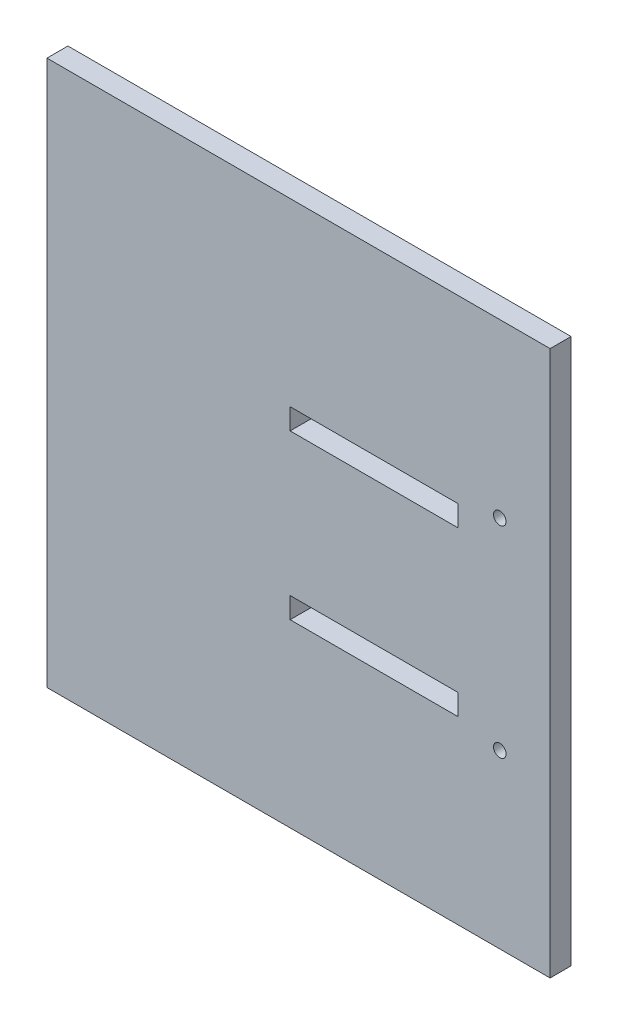
ISO-10303-21;
HEADER;
FILE_DESCRIPTION(('STEP AP214'),'2;1');
FILE_NAME('part.step','',(''),(''),'','','');
FILE_SCHEMA(('AUTOMOTIVE_DESIGN { 1 0 10303 214 1 1 1 1 }'));
ENDSEC;
DATA;
#1=APPLICATION_CONTEXT('core data for automotive mechanical design processes');
#2=APPLICATION_PROTOCOL_DEFINITION('international standard','automotive_design',2000,#1);
#3=PRODUCT_CONTEXT('',#1,'mechanical');
#4=PRODUCT('Part','Part','',(#3));
#5=PRODUCT_RELATED_PRODUCT_CATEGORY('part','',(#4));
#6=PRODUCT_DEFINITION_FORMATION('','',#4);
#7=PRODUCT_DEFINITION_CONTEXT('part definition',#1,'design');
#8=PRODUCT_DEFINITION('design','',#6,#7);
#9=PRODUCT_DEFINITION_SHAPE('','',#8);
#10=(LENGTH_UNIT() NAMED_UNIT(*) SI_UNIT(.MILLI.,.METRE.));
#11=(NAMED_UNIT(*) PLANE_ANGLE_UNIT() SI_UNIT($,.RADIAN.));
#12=(NAMED_UNIT(*) SI_UNIT($,.STERADIAN.) SOLID_ANGLE_UNIT());
#13=UNCERTAINTY_MEASURE_WITH_UNIT(LENGTH_MEASURE(1.E-05),#10,'distance_accuracy_value','');
#14=(GEOMETRIC_REPRESENTATION_CONTEXT(3) GLOBAL_UNCERTAINTY_ASSIGNED_CONTEXT((#13)) GLOBAL_UNIT_ASSIGNED_CONTEXT((#10,
#11,#12)) REPRESENTATION_CONTEXT('',''));
#15=CARTESIAN_POINT('',(0.,0.,0.));
#16=DIRECTION('',(0.,0.,1.));
#17=DIRECTION('',(1.,0.,0.));
#18=AXIS2_PLACEMENT_3D('',#15,#16,#17);
#19=CARTESIAN_POINT('',(0.,0.,5.));
#20=DIRECTION('',(0.,0.,1.));
#21=DIRECTION('',(1.,0.,0.));
#22=AXIS2_PLACEMENT_3D('',#19,#20,#21);
#23=PLANE('',#22);
#24=DIRECTION('',(-1.,0.,0.));
#25=VECTOR('',#24,1.);
#26=CARTESIAN_POINT('',(38.,-17.,5.));
#27=LINE('',#26,#25);
#28=CARTESIAN_POINT('',(38.,-17.,5.));
#29=VERTEX_POINT('',#28);
#30=CARTESIAN_POINT('',(-2.00000000000001,-17.,5.));
#31=VERTEX_POINT('',#30);
#32=EDGE_CURVE('E136',#29,#31,#27,.T.);
#33=ORIENTED_EDGE('',*,*,#32,.F.);
#34=DIRECTION('',(0.,1.,0.));
#35=VECTOR('',#34,1.);
#36=CARTESIAN_POINT('',(38.,-22.,5.));
#37=LINE('',#36,#35);
#38=CARTESIAN_POINT('',(38.,-22.,5.));
#39=VERTEX_POINT('',#38);
#40=EDGE_CURVE('E126',#39,#29,#37,.T.);
#41=ORIENTED_EDGE('',*,*,#40,.F.);
#42=DIRECTION('',(1.,0.,0.));
#43=VECTOR('',#42,1.);
#44=CARTESIAN_POINT('',(38.,-22.,5.));
#45=LINE('',#44,#43);
#46=CARTESIAN_POINT('',(-2.00000000000001,-22.,5.));
#47=VERTEX_POINT('',#46);
#48=EDGE_CURVE('E151',#47,#39,#45,.T.);
#49=ORIENTED_EDGE('',*,*,#48,.F.);
#50=DIRECTION('',(0.,-1.,0.));
#51=VECTOR('',#50,1.);
#52=CARTESIAN_POINT('',(-2.00000000000001,-22.,5.));
#53=LINE('',#52,#51);
#54=EDGE_CURVE('E149',#31,#47,#53,.T.);
#55=ORIENTED_EDGE('',*,*,#54,.F.);
#56=EDGE_LOOP('',(#33,#41,#49,#55));
#57=FACE_BOUND('',#56,.T.);
#58=CARTESIAN_POINT('',(48.,-24.,5.));
#59=DIRECTION('',(0.,0.,1.));
#60=DIRECTION('',(-1.,0.,0.));
#61=AXIS2_PLACEMENT_3D('',#58,#59,#60);
#62=CIRCLE('',#61,1.5);
#63=CARTESIAN_POINT('',(46.5,-24.,5.));
#64=VERTEX_POINT('',#63);
#65=EDGE_CURVE('E187',#64,#64,#62,.T.);
#66=ORIENTED_EDGE('',*,*,#65,.F.);
#67=EDGE_LOOP('',(#66));
#68=FACE_BOUND('',#67,.T.);
#69=DIRECTION('',(0.,1.,0.));
#70=VECTOR('',#69,1.);
#71=CARTESIAN_POINT('',(60.,65.,5.));
#72=LINE('',#71,#70);
#73=CARTESIAN_POINT('',(60.,-65.,5.));
#74=VERTEX_POINT('',#73);
#75=CARTESIAN_POINT('',(60.,65.,5.));
#76=VERTEX_POINT('',#75);
#77=EDGE_CURVE('E204',#74,#76,#72,.T.);
#78=ORIENTED_EDGE('',*,*,#77,.T.);
#79=DIRECTION('',(-1.,0.,0.));
#80=VECTOR('',#79,1.);
#81=CARTESIAN_POINT('',(-60.,65.,5.));
#82=LINE('',#81,#80);
#83=CARTESIAN_POINT('',(-60.,65.,5.));
#84=VERTEX_POINT('',#83);
#85=EDGE_CURVE('E207',#76,#84,#82,.T.);
#86=ORIENTED_EDGE('',*,*,#85,.T.);
#87=DIRECTION('',(0.,-1.,0.));
#88=VECTOR('',#87,1.);
#89=CARTESIAN_POINT('',(-60.,65.,5.));
#90=LINE('',#89,#88);
#91=CARTESIAN_POINT('',(-60.,-65.,5.));
#92=VERTEX_POINT('',#91);
#93=EDGE_CURVE('E210',#84,#92,#90,.T.);
#94=ORIENTED_EDGE('',*,*,#93,.T.);
#95=DIRECTION('',(1.,0.,0.));
#96=VECTOR('',#95,1.);
#97=CARTESIAN_POINT('',(-60.,-65.,5.));
#98=LINE('',#97,#96);
#99=EDGE_CURVE('E212',#92,#74,#98,.T.);
#100=ORIENTED_EDGE('',*,*,#99,.T.);
#101=EDGE_LOOP('',(#78,#86,#94,#100));
#102=FACE_BOUND('',#101,.T.);
#103=DIRECTION('',(1.,0.,0.));
#104=VECTOR('',#103,1.);
#105=CARTESIAN_POINT('',(38.,17.,5.));
#106=LINE('',#105,#104);
#107=CARTESIAN_POINT('',(-2.00000000000001,17.,5.));
#108=VERTEX_POINT('',#107);
#109=CARTESIAN_POINT('',(38.,17.,5.));
#110=VERTEX_POINT('',#109);
#111=EDGE_CURVE('E175',#108,#110,#106,.T.);
#112=ORIENTED_EDGE('',*,*,#111,.F.);
#113=DIRECTION('',(0.,-1.,0.));
#114=VECTOR('',#113,1.);
#115=CARTESIAN_POINT('',(-2.00000000000001,22.,5.));
#116=LINE('',#115,#114);
#117=CARTESIAN_POINT('',(-2.00000000000001,22.,5.));
#118=VERTEX_POINT('',#117);
#119=EDGE_CURVE('E173',#118,#108,#116,.T.);
#120=ORIENTED_EDGE('',*,*,#119,.F.);
#121=DIRECTION('',(-1.,0.,0.));
#122=VECTOR('',#121,1.);
#123=CARTESIAN_POINT('',(38.,22.,5.));
#124=LINE('',#123,#122);
#125=CARTESIAN_POINT('',(38.,22.,5.));
#126=VERTEX_POINT('',#125);
#127=EDGE_CURVE('E180',#126,#118,#124,.T.);
#128=ORIENTED_EDGE('',*,*,#127,.F.);
#129=DIRECTION('',(0.,1.,0.));
#130=VECTOR('',#129,1.);
#131=CARTESIAN_POINT('',(38.,22.,5.));
#132=LINE('',#131,#130);
#133=EDGE_CURVE('E178',#110,#126,#132,.T.);
#134=ORIENTED_EDGE('',*,*,#133,.F.);
#135=EDGE_LOOP('',(#112,#120,#128,#134));
#136=FACE_BOUND('',#135,.T.);
#137=CARTESIAN_POINT('',(48.,24.,5.));
#138=DIRECTION('',(0.,0.,1.));
#139=DIRECTION('',(1.,0.,0.));
#140=AXIS2_PLACEMENT_3D('',#137,#138,#139);
#141=CIRCLE('',#140,1.5);
#142=CARTESIAN_POINT('',(49.5,24.,5.));
#143=VERTEX_POINT('',#142);
#144=EDGE_CURVE('E158',#143,#143,#141,.T.);
#145=ORIENTED_EDGE('',*,*,#144,.F.);
#146=EDGE_LOOP('',(#145));
#147=FACE_BOUND('',#146,.T.);
#148=ADVANCED_FACE('F36',(#57,#68,#102,#136,#147),#23,.T.);
#149=CARTESIAN_POINT('',(0.,0.,0.));
#150=DIRECTION('',(0.,0.,1.));
#151=DIRECTION('',(1.,0.,0.));
#152=AXIS2_PLACEMENT_3D('',#149,#150,#151);
#153=PLANE('',#152);
#154=CARTESIAN_POINT('',(48.,-24.,0.));
#155=DIRECTION('',(0.,0.,1.));
#156=DIRECTION('',(-1.,0.,0.));
#157=AXIS2_PLACEMENT_3D('',#154,#155,#156);
#158=CIRCLE('',#157,1.5);
#159=CARTESIAN_POINT('',(46.5,-24.,0.));
#160=VERTEX_POINT('',#159);
#161=EDGE_CURVE('E144',#160,#160,#158,.T.);
#162=ORIENTED_EDGE('',*,*,#161,.T.);
#163=EDGE_LOOP('',(#162));
#164=FACE_BOUND('',#163,.T.);
#165=DIRECTION('',(0.,-1.,0.));
#166=VECTOR('',#165,1.);
#167=CARTESIAN_POINT('',(-2.00000000000001,22.,0.));
#168=LINE('',#167,#166);
#169=CARTESIAN_POINT('',(-2.00000000000001,22.,0.));
#170=VERTEX_POINT('',#169);
#171=CARTESIAN_POINT('',(-2.00000000000001,17.,0.));
#172=VERTEX_POINT('',#171);
#173=EDGE_CURVE('E183',#170,#172,#168,.T.);
#174=ORIENTED_EDGE('',*,*,#173,.T.);
#175=DIRECTION('',(1.,0.,0.));
#176=VECTOR('',#175,1.);
#177=CARTESIAN_POINT('',(38.,17.,0.));
#178=LINE('',#177,#176);
#179=CARTESIAN_POINT('',(38.,17.,0.));
#180=VERTEX_POINT('',#179);
#181=EDGE_CURVE('E186',#172,#180,#178,.T.);
#182=ORIENTED_EDGE('',*,*,#181,.T.);
#183=DIRECTION('',(0.,1.,0.));
#184=VECTOR('',#183,1.);
#185=CARTESIAN_POINT('',(38.,22.,0.));
#186=LINE('',#185,#184);
#187=CARTESIAN_POINT('',(38.,22.,0.));
#188=VERTEX_POINT('',#187);
#189=EDGE_CURVE('E190',#180,#188,#186,.T.);
#190=ORIENTED_EDGE('',*,*,#189,.T.);
#191=DIRECTION('',(-1.,0.,0.));
#192=VECTOR('',#191,1.);
#193=CARTESIAN_POINT('',(38.,22.,0.));
#194=LINE('',#193,#192);
#195=EDGE_CURVE('E176',#188,#170,#194,.T.);
#196=ORIENTED_EDGE('',*,*,#195,.T.);
#197=EDGE_LOOP('',(#174,#182,#190,#196));
#198=FACE_BOUND('',#197,.T.);
#199=DIRECTION('',(0.,1.,0.));
#200=VECTOR('',#199,1.);
#201=CARTESIAN_POINT('',(60.,65.,0.));
#202=LINE('',#201,#200);
#203=CARTESIAN_POINT('',(60.,-65.,0.));
#204=VERTEX_POINT('',#203);
#205=CARTESIAN_POINT('',(60.,65.,0.));
#206=VERTEX_POINT('',#205);
#207=EDGE_CURVE('E203',#204,#206,#202,.T.);
#208=ORIENTED_EDGE('',*,*,#207,.F.);
#209=DIRECTION('',(1.,0.,0.));
#210=VECTOR('',#209,1.);
#211=CARTESIAN_POINT('',(-60.,-65.,0.));
#212=LINE('',#211,#210);
#213=CARTESIAN_POINT('',(-60.,-65.,0.));
#214=VERTEX_POINT('',#213);
#215=EDGE_CURVE('E208',#214,#204,#212,.T.);
#216=ORIENTED_EDGE('',*,*,#215,.F.);
#217=DIRECTION('',(0.,-1.,0.));
#218=VECTOR('',#217,1.);
#219=CARTESIAN_POINT('',(-60.,65.,0.));
#220=LINE('',#219,#218);
#221=CARTESIAN_POINT('',(-60.,65.,0.));
#222=VERTEX_POINT('',#221);
#223=EDGE_CURVE('E219',#222,#214,#220,.T.);
#224=ORIENTED_EDGE('',*,*,#223,.F.);
#225=DIRECTION('',(-1.,0.,0.));
#226=VECTOR('',#225,1.);
#227=CARTESIAN_POINT('',(-60.,65.,0.));
#228=LINE('',#227,#226);
#229=EDGE_CURVE('E217',#206,#222,#228,.T.);
#230=ORIENTED_EDGE('',*,*,#229,.F.);
#231=EDGE_LOOP('',(#208,#216,#224,#230));
#232=FACE_BOUND('',#231,.T.);
#233=DIRECTION('',(0.,1.,0.));
#234=VECTOR('',#233,1.);
#235=CARTESIAN_POINT('',(38.,-22.,0.));
#236=LINE('',#235,#234);
#237=CARTESIAN_POINT('',(38.,-22.,0.));
#238=VERTEX_POINT('',#237);
#239=CARTESIAN_POINT('',(38.,-17.,0.));
#240=VERTEX_POINT('',#239);
#241=EDGE_CURVE('E156',#238,#240,#236,.T.);
#242=ORIENTED_EDGE('',*,*,#241,.T.);
#243=DIRECTION('',(-1.,0.,0.));
#244=VECTOR('',#243,1.);
#245=CARTESIAN_POINT('',(38.,-17.,0.));
#246=LINE('',#245,#244);
#247=CARTESIAN_POINT('',(-2.00000000000001,-17.,0.));
#248=VERTEX_POINT('',#247);
#249=EDGE_CURVE('E143',#240,#248,#246,.T.);
#250=ORIENTED_EDGE('',*,*,#249,.T.);
#251=DIRECTION('',(0.,-1.,0.));
#252=VECTOR('',#251,1.);
#253=CARTESIAN_POINT('',(-2.00000000000001,-22.,0.));
#254=LINE('',#253,#252);
#255=CARTESIAN_POINT('',(-2.00000000000001,-22.,0.));
#256=VERTEX_POINT('',#255);
#257=EDGE_CURVE('E160',#248,#256,#254,.T.);
#258=ORIENTED_EDGE('',*,*,#257,.T.);
#259=DIRECTION('',(1.,0.,0.));
#260=VECTOR('',#259,1.);
#261=CARTESIAN_POINT('',(38.,-22.,0.));
#262=LINE('',#261,#260);
#263=EDGE_CURVE('E137',#256,#238,#262,.T.);
#264=ORIENTED_EDGE('',*,*,#263,.T.);
#265=EDGE_LOOP('',(#242,#250,#258,#264));
#266=FACE_BOUND('',#265,.T.);
#267=CARTESIAN_POINT('',(48.,24.,0.));
#268=DIRECTION('',(0.,0.,1.));
#269=DIRECTION('',(1.,0.,0.));
#270=AXIS2_PLACEMENT_3D('',#267,#268,#269);
#271=CIRCLE('',#270,1.5);
#272=CARTESIAN_POINT('',(49.5,24.,0.));
#273=VERTEX_POINT('',#272);
#274=EDGE_CURVE('E170',#273,#273,#271,.T.);
#275=ORIENTED_EDGE('',*,*,#274,.T.);
#276=EDGE_LOOP('',(#275));
#277=FACE_BOUND('',#276,.T.);
#278=ADVANCED_FACE('F237',(#164,#198,#232,#266,#277),#153,.F.);
#279=CARTESIAN_POINT('',(60.,65.,5.));
#280=DIRECTION('',(-1.,0.,0.));
#281=DIRECTION('',(0.,0.,1.));
#282=AXIS2_PLACEMENT_3D('',#279,#280,#281);
#283=PLANE('',#282);
#284=ORIENTED_EDGE('',*,*,#207,.T.);
#285=DIRECTION('',(0.,0.,-1.));
#286=VECTOR('',#285,1.);
#287=CARTESIAN_POINT('',(60.,65.,5.));
#288=LINE('',#287,#286);
#289=EDGE_CURVE('E11',#76,#206,#288,.T.);
#290=ORIENTED_EDGE('',*,*,#289,.F.);
#291=ORIENTED_EDGE('',*,*,#77,.F.);
#292=DIRECTION('',(0.,0.,-1.));
#293=VECTOR('',#292,1.);
#294=CARTESIAN_POINT('',(60.,-65.,5.));
#295=LINE('',#294,#293);
#296=EDGE_CURVE('E214',#74,#204,#295,.T.);
#297=ORIENTED_EDGE('',*,*,#296,.T.);
#298=EDGE_LOOP('',(#284,#290,#291,#297));
#299=FACE_BOUND('',#298,.T.);
#300=ADVANCED_FACE('F38',(#299),#283,.F.);
#301=CARTESIAN_POINT('',(-60.,65.,5.));
#302=DIRECTION('',(0.,-1.,0.));
#303=DIRECTION('',(0.,0.,-1.));
#304=AXIS2_PLACEMENT_3D('',#301,#302,#303);
#305=PLANE('',#304);
#306=ORIENTED_EDGE('',*,*,#229,.T.);
#307=DIRECTION('',(0.,0.,-1.));
#308=VECTOR('',#307,1.);
#309=CARTESIAN_POINT('',(-60.,65.,5.));
#310=LINE('',#309,#308);
#311=EDGE_CURVE('E44',#84,#222,#310,.T.);
#312=ORIENTED_EDGE('',*,*,#311,.F.);
#313=ORIENTED_EDGE('',*,*,#85,.F.);
#314=ORIENTED_EDGE('',*,*,#289,.T.);
#315=EDGE_LOOP('',(#306,#312,#313,#314));
#316=FACE_BOUND('',#315,.T.);
#317=ADVANCED_FACE('F248',(#316),#305,.F.);
#318=CARTESIAN_POINT('',(-60.,65.,5.));
#319=DIRECTION('',(1.,0.,0.));
#320=DIRECTION('',(0.,0.,-1.));
#321=AXIS2_PLACEMENT_3D('',#318,#319,#320);
#322=PLANE('',#321);
#323=ORIENTED_EDGE('',*,*,#223,.T.);
#324=DIRECTION('',(0.,0.,-1.));
#325=VECTOR('',#324,1.);
#326=CARTESIAN_POINT('',(-60.,-65.,5.));
#327=LINE('',#326,#325);
#328=EDGE_CURVE('E224',#92,#214,#327,.T.);
#329=ORIENTED_EDGE('',*,*,#328,.F.);
#330=ORIENTED_EDGE('',*,*,#93,.F.);
#331=ORIENTED_EDGE('',*,*,#311,.T.);
#332=EDGE_LOOP('',(#323,#329,#330,#331));
#333=FACE_BOUND('',#332,.T.);
#334=ADVANCED_FACE('F231',(#333),#322,.F.);
#335=CARTESIAN_POINT('',(-60.,-65.,5.));
#336=DIRECTION('',(0.,1.,0.));
#337=DIRECTION('',(0.,0.,1.));
#338=AXIS2_PLACEMENT_3D('',#335,#336,#337);
#339=PLANE('',#338);
#340=ORIENTED_EDGE('',*,*,#215,.T.);
#341=ORIENTED_EDGE('',*,*,#296,.F.);
#342=ORIENTED_EDGE('',*,*,#99,.F.);
#343=ORIENTED_EDGE('',*,*,#328,.T.);
#344=EDGE_LOOP('',(#340,#341,#342,#343));
#345=FACE_BOUND('',#344,.T.);
#346=ADVANCED_FACE('F241',(#345),#339,.F.);
#347=CARTESIAN_POINT('',(-2.00000000000001,22.,5.));
#348=DIRECTION('',(1.,0.,0.));
#349=DIRECTION('',(0.,1.,0.));
#350=AXIS2_PLACEMENT_3D('',#347,#348,#349);
#351=PLANE('',#350);
#352=ORIENTED_EDGE('',*,*,#173,.F.);
#353=DIRECTION('',(0.,0.,-1.));
#354=VECTOR('',#353,1.);
#355=CARTESIAN_POINT('',(-2.00000000000001,22.,5.));
#356=LINE('',#355,#354);
#357=EDGE_CURVE('E182',#118,#170,#356,.T.);
#358=ORIENTED_EDGE('',*,*,#357,.F.);
#359=ORIENTED_EDGE('',*,*,#119,.T.);
#360=DIRECTION('',(0.,0.,-1.));
#361=VECTOR('',#360,1.);
#362=CARTESIAN_POINT('',(-2.00000000000001,17.,5.));
#363=LINE('',#362,#361);
#364=EDGE_CURVE('E200',#108,#172,#363,.T.);
#365=ORIENTED_EDGE('',*,*,#364,.T.);
#366=EDGE_LOOP('',(#352,#358,#359,#365));
#367=FACE_BOUND('',#366,.T.);
#368=ADVANCED_FACE('F263',(#367),#351,.T.);
#369=CARTESIAN_POINT('',(38.,17.,5.));
#370=DIRECTION('',(0.,1.,0.));
#371=DIRECTION('',(-1.,0.,0.));
#372=AXIS2_PLACEMENT_3D('',#369,#370,#371);
#373=PLANE('',#372);
#374=ORIENTED_EDGE('',*,*,#181,.F.);
#375=ORIENTED_EDGE('',*,*,#364,.F.);
#376=ORIENTED_EDGE('',*,*,#111,.T.);
#377=DIRECTION('',(0.,0.,-1.));
#378=VECTOR('',#377,1.);
#379=CARTESIAN_POINT('',(38.,17.,5.));
#380=LINE('',#379,#378);
#381=EDGE_CURVE('E198',#110,#180,#380,.T.);
#382=ORIENTED_EDGE('',*,*,#381,.T.);
#383=EDGE_LOOP('',(#374,#375,#376,#382));
#384=FACE_BOUND('',#383,.T.);
#385=ADVANCED_FACE('F270',(#384),#373,.T.);
#386=CARTESIAN_POINT('',(38.,22.,5.));
#387=DIRECTION('',(-1.,0.,0.));
#388=DIRECTION('',(0.,0.,1.));
#389=AXIS2_PLACEMENT_3D('',#386,#387,#388);
#390=PLANE('',#389);
#391=ORIENTED_EDGE('',*,*,#189,.F.);
#392=ORIENTED_EDGE('',*,*,#381,.F.);
#393=ORIENTED_EDGE('',*,*,#133,.T.);
#394=DIRECTION('',(0.,0.,-1.));
#395=VECTOR('',#394,1.);
#396=CARTESIAN_POINT('',(38.,22.,5.));
#397=LINE('',#396,#395);
#398=EDGE_CURVE('E59',#126,#188,#397,.T.);
#399=ORIENTED_EDGE('',*,*,#398,.T.);
#400=EDGE_LOOP('',(#391,#392,#393,#399));
#401=FACE_BOUND('',#400,.T.);
#402=ADVANCED_FACE('F275',(#401),#390,.T.);
#403=CARTESIAN_POINT('',(38.,22.,5.));
#404=DIRECTION('',(0.,-1.,0.));
#405=DIRECTION('',(1.,0.,0.));
#406=AXIS2_PLACEMENT_3D('',#403,#404,#405);
#407=PLANE('',#406);
#408=ORIENTED_EDGE('',*,*,#195,.F.);
#409=ORIENTED_EDGE('',*,*,#398,.F.);
#410=ORIENTED_EDGE('',*,*,#127,.T.);
#411=ORIENTED_EDGE('',*,*,#357,.T.);
#412=EDGE_LOOP('',(#408,#409,#410,#411));
#413=FACE_BOUND('',#412,.T.);
#414=ADVANCED_FACE('F281',(#413),#407,.T.);
#415=CARTESIAN_POINT('',(48.,-24.,5.));
#416=DIRECTION('',(0.,0.,-1.));
#417=DIRECTION('',(-1.,0.,0.));
#418=AXIS2_PLACEMENT_3D('',#415,#416,#417);
#419=CYLINDRICAL_SURFACE('',#418,1.5);
#420=ORIENTED_EDGE('',*,*,#65,.T.);
#421=EDGE_LOOP('',(#420));
#422=FACE_BOUND('',#421,.T.);
#423=ORIENTED_EDGE('',*,*,#161,.F.);
#424=EDGE_LOOP('',(#423));
#425=FACE_BOUND('',#424,.T.);
#426=ADVANCED_FACE('F308',(#422,#425),#419,.F.);
#427=CARTESIAN_POINT('',(38.,-22.,5.));
#428=DIRECTION('',(-1.,0.,0.));
#429=DIRECTION('',(0.,0.,1.));
#430=AXIS2_PLACEMENT_3D('',#427,#428,#429);
#431=PLANE('',#430);
#432=ORIENTED_EDGE('',*,*,#241,.F.);
#433=DIRECTION('',(0.,0.,-1.));
#434=VECTOR('',#433,1.);
#435=CARTESIAN_POINT('',(38.,-22.,5.));
#436=LINE('',#435,#434);
#437=EDGE_CURVE('E132',#39,#238,#436,.T.);
#438=ORIENTED_EDGE('',*,*,#437,.F.);
#439=ORIENTED_EDGE('',*,*,#40,.T.);
#440=DIRECTION('',(0.,0.,-1.));
#441=VECTOR('',#440,1.);
#442=CARTESIAN_POINT('',(38.,-17.,5.));
#443=LINE('',#442,#441);
#444=EDGE_CURVE('E129',#29,#240,#443,.T.);
#445=ORIENTED_EDGE('',*,*,#444,.T.);
#446=EDGE_LOOP('',(#432,#438,#439,#445));
#447=FACE_BOUND('',#446,.T.);
#448=ADVANCED_FACE('F128',(#447),#431,.T.);
#449=CARTESIAN_POINT('',(38.,-17.,5.));
#450=DIRECTION('',(0.,-1.,0.));
#451=DIRECTION('',(1.,0.,0.));
#452=AXIS2_PLACEMENT_3D('',#449,#450,#451);
#453=PLANE('',#452);
#454=ORIENTED_EDGE('',*,*,#249,.F.);
#455=ORIENTED_EDGE('',*,*,#444,.F.);
#456=ORIENTED_EDGE('',*,*,#32,.T.);
#457=DIRECTION('',(0.,0.,-1.));
#458=VECTOR('',#457,1.);
#459=CARTESIAN_POINT('',(-2.00000000000001,-17.,5.));
#460=LINE('',#459,#458);
#461=EDGE_CURVE('E145',#31,#248,#460,.T.);
#462=ORIENTED_EDGE('',*,*,#461,.T.);
#463=EDGE_LOOP('',(#454,#455,#456,#462));
#464=FACE_BOUND('',#463,.T.);
#465=ADVANCED_FACE('F140',(#464),#453,.T.);
#466=CARTESIAN_POINT('',(-2.00000000000001,-22.,5.));
#467=DIRECTION('',(1.,0.,0.));
#468=DIRECTION('',(0.,1.,0.));
#469=AXIS2_PLACEMENT_3D('',#466,#467,#468);
#470=PLANE('',#469);
#471=ORIENTED_EDGE('',*,*,#257,.F.);
#472=ORIENTED_EDGE('',*,*,#461,.F.);
#473=ORIENTED_EDGE('',*,*,#54,.T.);
#474=DIRECTION('',(0.,0.,-1.));
#475=VECTOR('',#474,1.);
#476=CARTESIAN_POINT('',(-2.00000000000001,-22.,5.));
#477=LINE('',#476,#475);
#478=EDGE_CURVE('E51',#47,#256,#477,.T.);
#479=ORIENTED_EDGE('',*,*,#478,.T.);
#480=EDGE_LOOP('',(#471,#472,#473,#479));
#481=FACE_BOUND('',#480,.T.);
#482=ADVANCED_FACE('F301',(#481),#470,.T.);
#483=CARTESIAN_POINT('',(38.,-22.,5.));
#484=DIRECTION('',(0.,1.,0.));
#485=DIRECTION('',(-1.,0.,0.));
#486=AXIS2_PLACEMENT_3D('',#483,#484,#485);
#487=PLANE('',#486);
#488=ORIENTED_EDGE('',*,*,#263,.F.);
#489=ORIENTED_EDGE('',*,*,#478,.F.);
#490=ORIENTED_EDGE('',*,*,#48,.T.);
#491=ORIENTED_EDGE('',*,*,#437,.T.);
#492=EDGE_LOOP('',(#488,#489,#490,#491));
#493=FACE_BOUND('',#492,.T.);
#494=ADVANCED_FACE('F294',(#493),#487,.T.);
#495=CARTESIAN_POINT('',(48.,24.,5.));
#496=DIRECTION('',(0.,0.,-1.));
#497=DIRECTION('',(-1.,0.,0.));
#498=AXIS2_PLACEMENT_3D('',#495,#496,#497);
#499=CYLINDRICAL_SURFACE('',#498,1.5);
#500=ORIENTED_EDGE('',*,*,#144,.T.);
#501=EDGE_LOOP('',(#500));
#502=FACE_BOUND('',#501,.T.);
#503=ORIENTED_EDGE('',*,*,#274,.F.);
#504=EDGE_LOOP('',(#503));
#505=FACE_BOUND('',#504,.T.);
#506=ADVANCED_FACE('F291',(#502,#505),#499,.F.);
#507=CLOSED_SHELL('',(#148,#278,#300,#317,#334,#346,#368,#385,#402,#414,#426,#448,#465,#482,
#494,#506));
#508=MANIFOLD_SOLID_BREP('B2',#507);
#509=ADVANCED_BREP_SHAPE_REPRESENTATION('',(#18,#508),#14);
#510=SHAPE_DEFINITION_REPRESENTATION(#9,#509);
ENDSEC;
END-ISO-10303-21;
